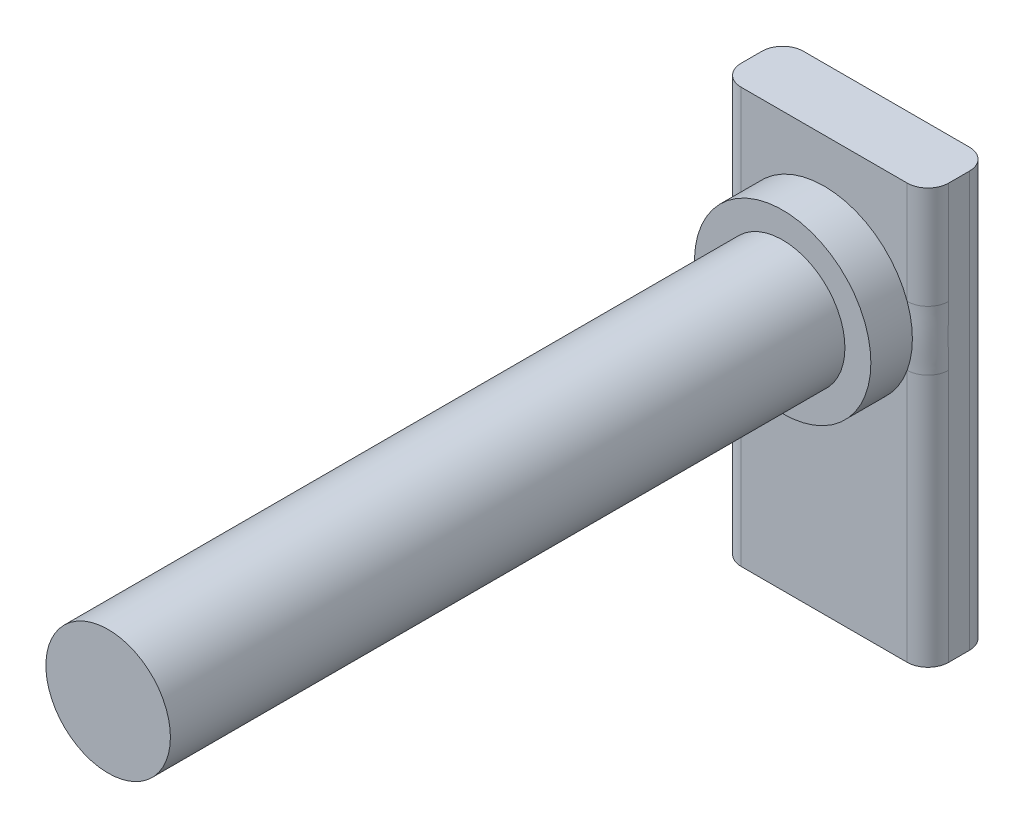
ISO-10303-21;
HEADER;
FILE_DESCRIPTION(('STEP AP214'),'2;1');
FILE_NAME('part.step','',(''),(''),'','','');
FILE_SCHEMA(('AUTOMOTIVE_DESIGN { 1 0 10303 214 1 1 1 1 }'));
ENDSEC;
DATA;
#1=APPLICATION_CONTEXT('core data for automotive mechanical design processes');
#2=APPLICATION_PROTOCOL_DEFINITION('international standard','automotive_design',2000,#1);
#3=PRODUCT_CONTEXT('',#1,'mechanical');
#4=PRODUCT('Part','Part','',(#3));
#5=PRODUCT_RELATED_PRODUCT_CATEGORY('part','',(#4));
#6=PRODUCT_DEFINITION_FORMATION('','',#4);
#7=PRODUCT_DEFINITION_CONTEXT('part definition',#1,'design');
#8=PRODUCT_DEFINITION('design','',#6,#7);
#9=PRODUCT_DEFINITION_SHAPE('','',#8);
#10=(LENGTH_UNIT() NAMED_UNIT(*) SI_UNIT(.MILLI.,.METRE.));
#11=(NAMED_UNIT(*) PLANE_ANGLE_UNIT() SI_UNIT($,.RADIAN.));
#12=(NAMED_UNIT(*) SI_UNIT($,.STERADIAN.) SOLID_ANGLE_UNIT());
#13=UNCERTAINTY_MEASURE_WITH_UNIT(LENGTH_MEASURE(1.E-05),#10,'distance_accuracy_value','');
#14=(GEOMETRIC_REPRESENTATION_CONTEXT(3) GLOBAL_UNCERTAINTY_ASSIGNED_CONTEXT((#13)) GLOBAL_UNIT_ASSIGNED_CONTEXT((#10,
#11,#12)) REPRESENTATION_CONTEXT('',''));
#15=CARTESIAN_POINT('',(0.,0.,0.));
#16=DIRECTION('',(0.,0.,1.));
#17=DIRECTION('',(1.,0.,0.));
#18=AXIS2_PLACEMENT_3D('',#15,#16,#17);
#19=CARTESIAN_POINT('',(-10.,40.,3.));
#20=DIRECTION('',(0.,0.,-1.));
#21=DIRECTION('',(-1.,0.,0.));
#22=AXIS2_PLACEMENT_3D('',#19,#20,#21);
#23=PLANE('',#22);
#24=DIRECTION('',(1.,0.,0.));
#25=VECTOR('',#24,1.);
#26=CARTESIAN_POINT('',(-10.,40.,3.));
#27=LINE('',#26,#25);
#28=CARTESIAN_POINT('',(-8.,40.,3.));
#29=VERTEX_POINT('',#28);
#30=CARTESIAN_POINT('',(8.,40.,3.));
#31=VERTEX_POINT('',#30);
#32=EDGE_CURVE('E286',#29,#31,#27,.T.);
#33=ORIENTED_EDGE('',*,*,#32,.F.);
#34=DIRECTION('',(0.,-1.,0.));
#35=VECTOR('',#34,1.);
#36=CARTESIAN_POINT('',(-8.,40.,3.));
#37=LINE('',#36,#35);
#38=CARTESIAN_POINT('',(-8.,30.122281323269,3.));
#39=VERTEX_POINT('',#38);
#40=EDGE_CURVE('E169',#29,#39,#37,.T.);
#41=ORIENTED_EDGE('',*,*,#40,.T.);
#42=CARTESIAN_POINT('',(0.,27.25,3.));
#43=DIRECTION('',(0.,0.,-1.));
#44=DIRECTION('',(-1.,0.,0.));
#45=AXIS2_PLACEMENT_3D('',#42,#43,#44);
#46=CIRCLE('',#45,8.5);
#47=CARTESIAN_POINT('',(8.,30.122281323269,3.));
#48=VERTEX_POINT('',#47);
#49=EDGE_CURVE('E144',#48,#39,#46,.F.);
#50=ORIENTED_EDGE('',*,*,#49,.F.);
#51=DIRECTION('',(0.,-1.,0.));
#52=VECTOR('',#51,1.);
#53=CARTESIAN_POINT('',(8.,40.,3.));
#54=LINE('',#53,#52);
#55=EDGE_CURVE('E159',#48,#31,#54,.F.);
#56=ORIENTED_EDGE('',*,*,#55,.T.);
#57=EDGE_LOOP('',(#33,#41,#50,#56));
#58=FACE_BOUND('',#57,.T.);
#59=ADVANCED_FACE('F39',(#58),#23,.F.);
#60=CARTESIAN_POINT('',(-10.,40.,-3.));
#61=DIRECTION('',(1.,0.,0.));
#62=DIRECTION('',(0.,0.,-1.));
#63=AXIS2_PLACEMENT_3D('',#60,#61,#62);
#64=PLANE('',#63);
#65=DIRECTION('',(0.,0.,1.));
#66=VECTOR('',#65,1.);
#67=CARTESIAN_POINT('',(-10.,0.,-3.));
#68=LINE('',#67,#66);
#69=CARTESIAN_POINT('',(-10.,0.,-1.));
#70=VERTEX_POINT('',#69);
#71=CARTESIAN_POINT('',(-10.,0.,1.));
#72=VERTEX_POINT('',#71);
#73=EDGE_CURVE('E348',#70,#72,#68,.T.);
#74=ORIENTED_EDGE('',*,*,#73,.T.);
#75=DIRECTION('',(0.,-1.,0.));
#76=VECTOR('',#75,1.);
#77=CARTESIAN_POINT('',(-10.,40.,1.));
#78=LINE('',#77,#76);
#79=CARTESIAN_POINT('',(-10.,24.377718676731,1.));
#80=VERTEX_POINT('',#79);
#81=EDGE_CURVE('E333',#72,#80,#78,.F.);
#82=ORIENTED_EDGE('',*,*,#81,.T.);
#83=CARTESIAN_POINT('',(-10.,32.1742305538704,1.21095364486494));
#84=CARTESIAN_POINT('',(-10.,31.4175147859242,4.09970453840796));
#85=CARTESIAN_POINT('',(-7.23862971994848,31.7055852340045,3.));
#86=CARTESIAN_POINT('',(-10.,32.0611079786536,1.18135774137184));
#87=CARTESIAN_POINT('',(-10.,31.39549822083,4.01275273274164));
#88=CARTESIAN_POINT('',(-7.2843148394478,31.6313757692248,3.));
#89=CARTESIAN_POINT('',(-10.,31.9470060698169,1.15585246402786));
#90=CARTESIAN_POINT('',(-10.,31.3597545242937,3.92803932344696));
#91=CARTESIAN_POINT('',(-7.33013269160796,31.5543717103597,3.));
#92=CARTESIAN_POINT('',(-10.,31.7175920562914,1.11188087408796));
#93=CARTESIAN_POINT('',(-10.,31.2667596127327,3.76815384213583));
#94=CARTESIAN_POINT('',(-7.42135843620194,31.3950962960003,3.));
#95=CARTESIAN_POINT('',(-10.,31.6022816838911,1.09340561061509));
#96=CARTESIAN_POINT('',(-10.,31.2101429271235,3.69252360930276));
#97=CARTESIAN_POINT('',(-7.46676677759371,31.3128317953243,3.));
#98=CARTESIAN_POINT('',(-10.,31.3714987813985,1.06236171776447));
#99=CARTESIAN_POINT('',(-10.,31.0810369633531,3.55171605711475));
#100=CARTESIAN_POINT('',(-7.5563881842569,31.1436005186026,3.));
#101=CARTESIAN_POINT('',(-10.,31.2560300968972,1.04976336246578));
#102=CARTESIAN_POINT('',(-10.,31.0089798835651,3.48607680965296));
#103=CARTESIAN_POINT('',(-7.60060617493571,31.0566599439555,3.));
#104=CARTESIAN_POINT('',(-10.,31.0246419075179,1.02933544634426));
#105=CARTESIAN_POINT('',(-10.,30.8526620066706,3.36434357875298));
#106=CARTESIAN_POINT('',(-7.68755980963737,30.8778528735251,3.));
#107=CARTESIAN_POINT('',(-10.,30.9087222589015,1.02150755738733));
#108=CARTESIAN_POINT('',(-10.,30.7685609346231,3.30788932172753));
#109=CARTESIAN_POINT('',(-7.730294929028,30.7859846630522,3.));
#110=CARTESIAN_POINT('',(-10.,30.5619183886198,1.00385470347928));
#111=CARTESIAN_POINT('',(-10.,30.5062691683153,3.15427856502097));
#112=CARTESIAN_POINT('',(-7.85503489667644,30.5042906134472,3.));
#113=CARTESIAN_POINT('',(-10.,30.3307571929287,0.999715917369383));
#114=CARTESIAN_POINT('',(-10.,30.3114667741329,3.06680903547543));
#115=CARTESIAN_POINT('',(-7.93406173340116,30.3074718790006,3.));
#116=CARTESIAN_POINT('',(-10.,29.8682135241245,1.00031354631181));
#117=CARTESIAN_POINT('',(-10.,29.9001338176205,2.92143089467112));
#118=CARTESIAN_POINT('',(-8.08040028074587,29.8966500098235,3.));
#119=CARTESIAN_POINT('',(-10.,29.6368312222705,1.00506295888962));
#120=CARTESIAN_POINT('',(-10.,29.6827498479941,2.86195918734718));
#121=CARTESIAN_POINT('',(-8.14769467728004,29.682622147642,3.));
#122=CARTESIAN_POINT('',(-10.,29.1569620354086,1.01853515381541));
#123=CARTESIAN_POINT('',(-10.,29.2193368637906,2.76235809361198));
#124=CARTESIAN_POINT('',(-8.27135516333418,29.2236328276485,3.));
#125=CARTESIAN_POINT('',(-10.,28.908483985395,1.02752738419817));
#126=CARTESIAN_POINT('',(-10.,28.9701752541155,2.72272542112594));
#127=CARTESIAN_POINT('',(-8.32653492488588,28.9775546651703,3.));
#128=CARTESIAN_POINT('',(-10.,28.4116163754647,1.04405910861875));
#129=CARTESIAN_POINT('',(-10.,28.4649689258032,2.66318367046132));
#130=CARTESIAN_POINT('',(-8.4153992799378,28.4733162510156,3.));
#131=CARTESIAN_POINT('',(-10.,28.1632268469108,1.05159943567479));
#132=CARTESIAN_POINT('',(-10.,28.2066888657191,2.64262109487295));
#133=CARTESIAN_POINT('',(-8.44909622483952,28.2151630336255,3.));
#134=CARTESIAN_POINT('',(-10.,27.6661063063211,1.06160028312711));
#135=CARTESIAN_POINT('',(-10.,27.6882489902641,2.61686176603129));
#136=CARTESIAN_POINT('',(-8.49253167471214,27.6924036973262,3.));
#137=CARTESIAN_POINT('',(-10.,27.4173751868783,1.06405628854081));
#138=CARTESIAN_POINT('',(-10.,27.4255748641736,2.61141857767124));
#139=CARTESIAN_POINT('',(-8.50224888665426,27.4277920539613,3.));
#140=CARTESIAN_POINT('',(-10.,26.919888048319,1.06274677884511));
#141=CARTESIAN_POINT('',(-10.,26.9032764860434,2.61448866869509));
#142=CARTESIAN_POINT('',(-8.49687185453577,26.8993090777777,3.));
#143=CARTESIAN_POINT('',(-10.,26.6711320327885,1.05898014292222));
#144=CARTESIAN_POINT('',(-10.,26.6410634368824,2.62303477231418));
#145=CARTESIAN_POINT('',(-8.48177314066766,26.6354378869039,3.));
#146=CARTESIAN_POINT('',(-10.,26.2589159364716,1.04904307632406));
#147=CARTESIAN_POINT('',(-10.,26.2136038980973,2.64996515719741));
#148=CARTESIAN_POINT('',(-8.43720189599295,26.2043901872877,3.));
#149=CARTESIAN_POINT('',(-10.,26.0954204080665,1.04413766495513));
#150=CARTESIAN_POINT('',(-10.,26.0444939872155,2.66412486846108));
#151=CARTESIAN_POINT('',(-8.41442292464661,26.0350472918182,3.));
#152=CARTESIAN_POINT('',(-10.,25.7684723838228,1.03350589729117));
#153=CARTESIAN_POINT('',(-10.,25.7106453381815,2.70025292082646));
#154=CARTESIAN_POINT('',(-8.35944007986045,25.701346384731,3.));
#155=CARTESIAN_POINT('',(-10.,25.6050198854074,1.02777961667695));
#156=CARTESIAN_POINT('',(-10.,25.5452563336138,2.72238744351901));
#157=CARTESIAN_POINT('',(-8.32723707499358,25.5369879152601,3.));
#158=CARTESIAN_POINT('',(-10.,25.2782637020742,1.01692019739131));
#159=CARTESIAN_POINT('',(-10.,25.2206604420998,2.7759061619357));
#160=CARTESIAN_POINT('',(-8.25441048197649,25.2148172799662,3.));
#161=CARTESIAN_POINT('',(-10.,25.1149600394352,1.01178644727281));
#162=CARTESIAN_POINT('',(-10.,25.0608716392072,2.8075412961384));
#163=CARTESIAN_POINT('',(-8.21379569735163,25.0569984755063,3.));
#164=CARTESIAN_POINT('',(-10.,24.7882990823041,1.00380039117724));
#165=CARTESIAN_POINT('',(-10.,24.7494108213875,2.88186810940857));
#166=CARTESIAN_POINT('',(-8.12526598223164,24.7488494785581,3.));
#167=CARTESIAN_POINT('',(-10.,24.6249417913994,1.0009479551823));
#168=CARTESIAN_POINT('',(-10.,24.5972728511241,2.92494111576139));
#169=CARTESIAN_POINT('',(-8.07735146795188,24.5985188597572,3.));
#170=CARTESIAN_POINT('',(-10.,24.2862575691042,0.999388150210553));
#171=CARTESIAN_POINT('',(-10.,24.293010901867,3.02790455164852));
#172=CARTESIAN_POINT('',(-7.97174289051109,24.2955291406349,3.));
#173=CARTESIAN_POINT('',(-10.,24.1109275108449,1.00099862008363));
#174=CARTESIAN_POINT('',(-10.,24.1416302241075,3.08933725599558));
#175=CARTESIAN_POINT('',(-7.91359022723904,24.1435013809035,3.));
#176=CARTESIAN_POINT('',(-10.,23.7606080775338,1.01171589094146));
#177=CARTESIAN_POINT('',(-10.,23.8568927412528,3.22975908509041));
#178=CARTESIAN_POINT('',(-7.79199829839254,23.8500027060113,3.));
#179=CARTESIAN_POINT('',(-10.,23.585618541079,1.02081655302892));
#180=CARTESIAN_POINT('',(-10.,23.7234635399509,3.30965900255887));
#181=CARTESIAN_POINT('',(-7.72856340034755,23.7085232490758,3.));
#182=CARTESIAN_POINT('',(-10.,23.2350646098877,1.04963867428003));
#183=CARTESIAN_POINT('',(-10.,23.4813967476423,3.48998797639246));
#184=CARTESIAN_POINT('',(-7.59758387340209,23.4355804147346,3.));
#185=CARTESIAN_POINT('',(-10.,23.0595061511386,1.06944131102034));
#186=CARTESIAN_POINT('',(-10.,23.3734949343701,3.5917957419354));
#187=CARTESIAN_POINT('',(-7.53001137945784,23.3042024761798,3.));
#188=CARTESIAN_POINT('',(-10.,22.7975517377895,1.10986863126105));
#189=CARTESIAN_POINT('',(-10.,23.2421136445889,3.75807507381838));
#190=CARTESIAN_POINT('',(-7.42728422373314,23.1159235226725,3.));
#191=CARTESIAN_POINT('',(-10.,22.7103346219837,1.12516260247632));
#192=CARTESIAN_POINT('',(-10.,23.2028658035795,3.81711114874101));
#193=CARTESIAN_POINT('',(-7.39276105715877,23.0545432608375,3.));
#194=CARTESIAN_POINT('',(-10.,22.5366709522816,1.15987004434311));
#195=CARTESIAN_POINT('',(-10.,23.1365175033274,3.94012067376457));
#196=CARTESIAN_POINT('',(-7.32353753322398,22.9348424366964,3.));
#197=CARTESIAN_POINT('',(-10.,22.450224922852,1.17928612467114));
#198=CARTESIAN_POINT('',(-10.,23.1097069601356,4.00429324037911));
#199=CARTESIAN_POINT('',(-7.28883707726927,22.8765238420201,3.));
#200=CARTESIAN_POINT('',(-10.,22.3643294372693,1.20102259422304));
#201=CARTESIAN_POINT('',(-10.,23.0906453720776,4.0697618182808));
#202=CARTESIAN_POINT('',(-7.25419375221729,22.8197998910555,3.));
#203=(BOUNDED_SURFACE() B_SPLINE_SURFACE(3,2,((#83,#84,#85),(#86,#87,#88),(#89,#90,#91),(#92,
#93,#94),(#95,#96,#97),(#98,#99,#100),(#101,#102,#103),(#104,#105,#106),(#107,#108,#109),(#110,
#111,#112),(#113,#114,#115),(#116,#117,#118),(#119,#120,#121),(#122,#123,#124),(#125,#126,#127),
(#128,#129,#130),(#131,#132,#133),(#134,#135,#136),(#137,#138,#139),(#140,#141,#142),(#143,#144,
#145),(#146,#147,#148),(#149,#150,#151),(#152,#153,#154),(#155,#156,#157),(#158,#159,#160),
(#161,#162,#163),(#164,#165,#166),(#167,#168,#169),(#170,#171,#172),(#173,#174,#175),(#176,#177,
#178),(#179,#180,#181),(#182,#183,#184),(#185,#186,#187),(#188,#189,#190),(#191,#192,#193),
(#194,#195,#196),(#197,#198,#199),(#200,#201,#202)),.UNSPECIFIED.,.F.,.F.,
.F.) B_SPLINE_SURFACE_WITH_KNOTS((4,2,2,2,2,2,2,2,2,2,2,2,2,2,2,2,2,2,2,4),(3,3),(0.,
0.350587874443632,0.700727861604529,1.04907707501846,1.39754830139852,2.09077806843667,
2.78502236195023,3.53094372950157,4.27643584687634,5.02258969315867,5.76887795028599,
6.25958199540092,6.75024082865455,7.2403887241767,7.73050868294059,8.25641259113918,
8.78188590172446,9.31140219902955,9.57695662561053,9.84267967674416),(0.,1.),
.UNSPECIFIED.) GEOMETRIC_REPRESENTATION_ITEM() RATIONAL_B_SPLINE_SURFACE(((1.,0.556468714293195,
1.),(1.,0.566731908977172,1.),(1.,0.576739177256572,1.),(1.,0.596182629575777,1.),(1.,
0.605619526861314,1.),(1.,0.623842746561731,1.),(1.,0.632632149463142,1.),(1.,0.649585847703021,
1.),(1.,0.657749923012702,1.),(1.,0.68117703495113,1.),(1.,0.695472360590649,1.),(1.,
0.721295442439472,1.),(1.,0.732819117754684,1.),(1.,0.75362817110224,1.),(1.,0.762683088060061,
1.),(1.,0.777111411886055,1.),(1.,0.782486934328605,1.),(1.,0.789395360913482,1.),(1.,
0.790924849957231,1.),(1.,0.790074951022299,1.),(1.,0.787694858855736,1.),(1.,0.780581487233211,
1.),(1.,0.776933269939079,1.),(1.,0.768036471580732,1.),(1.,0.762788037999756,1.),(1.,
0.750758716728986,1.),(1.,0.743979430520764,1.),(1.,0.728953303786449,1.),(1.,0.720706546927971,
1.),(1.,0.702159435581077,1.),(1.,0.691753106433346,1.),(1.,0.669420748345164,1.),(1.,
0.657495970675108,1.),(1.,0.632106155436567,1.),(1.,0.618629973039805,1.),(1.,0.597387124379166,
1.),(1.,0.590123096737183,1.),(1.,0.575273529030415,1.),(1.,0.567687787737227,1.),(1.,
0.559953960655983,1.))) REPRESENTATION_ITEM('') SURFACE());
#204=CARTESIAN_POINT('',(-10.,22.3643294372693,1.20102259422304));
#205=CARTESIAN_POINT('',(-10.,22.450224922852,1.17928612467114));
#206=CARTESIAN_POINT('',(-10.,22.5366709522816,1.15987004434311));
#207=CARTESIAN_POINT('',(-10.,22.7103346219837,1.12516260247632));
#208=CARTESIAN_POINT('',(-10.,22.7975517377895,1.10986863126105));
#209=CARTESIAN_POINT('',(-10.,23.0595061511386,1.06944131102034));
#210=CARTESIAN_POINT('',(-10.,23.2350646098877,1.04963867428003));
#211=CARTESIAN_POINT('',(-10.,23.585618541079,1.02081655302892));
#212=CARTESIAN_POINT('',(-10.,23.7606080775338,1.01171589094146));
#213=CARTESIAN_POINT('',(-10.,24.1109275108449,1.00099862008363));
#214=CARTESIAN_POINT('',(-10.,24.2862575691042,0.999388150210553));
#215=CARTESIAN_POINT('',(-10.,24.6249417913994,1.0009479551823));
#216=CARTESIAN_POINT('',(-10.,24.7882990823041,1.00380039117724));
#217=CARTESIAN_POINT('',(-10.,25.1149600394352,1.01178644727281));
#218=CARTESIAN_POINT('',(-10.,25.2782637020742,1.01692019739131));
#219=CARTESIAN_POINT('',(-10.,25.6050198854074,1.02777961667695));
#220=CARTESIAN_POINT('',(-10.,25.7684723838228,1.03350589729117));
#221=CARTESIAN_POINT('',(-10.,26.0954204080665,1.04413766495513));
#222=CARTESIAN_POINT('',(-10.,26.2589159364716,1.04904307632406));
#223=CARTESIAN_POINT('',(-10.,26.6711320327885,1.05898014292222));
#224=CARTESIAN_POINT('',(-10.,26.919888048319,1.06274677884511));
#225=CARTESIAN_POINT('',(-10.,27.4173751868783,1.06405628854081));
#226=CARTESIAN_POINT('',(-10.,27.6661063063211,1.06160028312711));
#227=CARTESIAN_POINT('',(-10.,28.1632268469108,1.05159943567479));
#228=CARTESIAN_POINT('',(-10.,28.4116163754647,1.04405910861875));
#229=CARTESIAN_POINT('',(-10.,28.9084839853949,1.02752738419817));
#230=CARTESIAN_POINT('',(-10.,29.1569620354086,1.01853515381541));
#231=CARTESIAN_POINT('',(-10.,29.6368312222705,1.00506295888962));
#232=CARTESIAN_POINT('',(-10.,29.8682135241245,1.00031354631181));
#233=CARTESIAN_POINT('',(-10.,30.3307571929287,0.999715917369383));
#234=CARTESIAN_POINT('',(-10.,30.5619183886198,1.00385470347928));
#235=CARTESIAN_POINT('',(-10.,30.9087222589015,1.02150755738733));
#236=CARTESIAN_POINT('',(-10.,31.0246419075179,1.02933544634426));
#237=CARTESIAN_POINT('',(-10.,31.2560300968972,1.04976336246578));
#238=CARTESIAN_POINT('',(-10.,31.3714987813985,1.06236171776447));
#239=CARTESIAN_POINT('',(-10.,31.6022816838911,1.09340561061509));
#240=CARTESIAN_POINT('',(-10.,31.7175920562914,1.11188087408796));
#241=CARTESIAN_POINT('',(-10.,31.9470060698169,1.15585246402786));
#242=CARTESIAN_POINT('',(-10.,32.0611079786536,1.18135774137184));
#243=CARTESIAN_POINT('',(-10.,32.1742305538704,1.21095364486494));
#244=B_SPLINE_CURVE_WITH_KNOTS('',3,(#204,#205,#206,#207,#208,#209,#210,#211,#212,#213,#214,
#215,#216,#217,#218,#219,#220,#221,#222,#223,#224,#225,#226,#227,#228,#229,#230,#231,#232,#233,
#234,#235,#236,#237,#238,#239,#240,#241,#242,#243),.UNSPECIFIED.,.F.,.F.,(4,2,2,2,2,2,2,2,2,2,2,
2,2,2,2,2,2,2,2,4),(0.,0.265723051133621,0.531277477714602,1.0607937750197,1.58626708560497,
2.11217099380357,2.60229095256745,3.09243884808961,3.58309768134323,4.07380172645817,
4.82008998358548,5.56624382986782,6.31173594724259,7.05765731479392,7.75190160830748,
8.44513137534564,8.79360260172569,9.14195181513963,9.49209180230052,9.84267967674416),.UNSPECIFIED.);
#245=CARTESIAN_POINT('',(-10.,30.122281323269,1.));
#246=VERTEX_POINT('',#245);
#247=EDGE_CURVE('E172',#80,#246,#244,.T.);
#248=ORIENTED_EDGE('',*,*,#247,.T.);
#249=DIRECTION('',(0.,-1.,0.));
#250=VECTOR('',#249,1.);
#251=CARTESIAN_POINT('',(-10.,40.,1.));
#252=LINE('',#251,#250);
#253=CARTESIAN_POINT('',(-10.,40.,1.));
#254=VERTEX_POINT('',#253);
#255=EDGE_CURVE('E326',#246,#254,#252,.F.);
#256=ORIENTED_EDGE('',*,*,#255,.T.);
#257=DIRECTION('',(0.,0.,1.));
#258=VECTOR('',#257,1.);
#259=CARTESIAN_POINT('',(-10.,40.,-3.));
#260=LINE('',#259,#258);
#261=CARTESIAN_POINT('',(-10.,40.,-1.));
#262=VERTEX_POINT('',#261);
#263=EDGE_CURVE('E304',#262,#254,#260,.T.);
#264=ORIENTED_EDGE('',*,*,#263,.F.);
#265=DIRECTION('',(0.,-1.,0.));
#266=VECTOR('',#265,1.);
#267=CARTESIAN_POINT('',(-10.,40.,-1.));
#268=LINE('',#267,#266);
#269=EDGE_CURVE('E323',#262,#70,#268,.T.);
#270=ORIENTED_EDGE('',*,*,#269,.T.);
#271=EDGE_LOOP('',(#74,#82,#248,#256,#264,#270));
#272=FACE_BOUND('',#271,.T.);
#273=ADVANCED_FACE('F262',(#272),#64,.F.);
#274=CARTESIAN_POINT('',(-8.,24.377718676731,3.));
#275=VERTEX_POINT('',#274);
#276=CARTESIAN_POINT('',(8.,24.377718676731,3.));
#277=VERTEX_POINT('',#276);
#278=EDGE_CURVE('E142',#275,#277,#46,.F.);
#279=ORIENTED_EDGE('',*,*,#278,.F.);
#280=DIRECTION('',(0.,-1.,0.));
#281=VECTOR('',#280,1.);
#282=CARTESIAN_POINT('',(-8.,40.,3.));
#283=LINE('',#282,#281);
#284=CARTESIAN_POINT('',(-8.,0.,3.));
#285=VERTEX_POINT('',#284);
#286=EDGE_CURVE('E155',#275,#285,#283,.T.);
#287=ORIENTED_EDGE('',*,*,#286,.T.);
#288=DIRECTION('',(1.,0.,0.));
#289=VECTOR('',#288,1.);
#290=CARTESIAN_POINT('',(-10.,0.,3.));
#291=LINE('',#290,#289);
#292=CARTESIAN_POINT('',(8.,0.,3.));
#293=VERTEX_POINT('',#292);
#294=EDGE_CURVE('E309',#285,#293,#291,.T.);
#295=ORIENTED_EDGE('',*,*,#294,.T.);
#296=DIRECTION('',(0.,-1.,0.));
#297=VECTOR('',#296,1.);
#298=CARTESIAN_POINT('',(8.,40.,3.));
#299=LINE('',#298,#297);
#300=EDGE_CURVE('E158',#293,#277,#299,.F.);
#301=ORIENTED_EDGE('',*,*,#300,.T.);
#302=EDGE_LOOP('',(#279,#287,#295,#301));
#303=FACE_BOUND('',#302,.T.);
#304=ADVANCED_FACE('F153',(#303),#23,.F.);
#305=CARTESIAN_POINT('',(10.,40.,-3.));
#306=DIRECTION('',(-1.,0.,0.));
#307=DIRECTION('',(0.,0.,1.));
#308=AXIS2_PLACEMENT_3D('',#305,#306,#307);
#309=PLANE('',#308);
#310=DIRECTION('',(0.,0.,-1.));
#311=VECTOR('',#310,1.);
#312=CARTESIAN_POINT('',(10.,40.,-3.));
#313=LINE('',#312,#311);
#314=CARTESIAN_POINT('',(10.,40.,1.));
#315=VERTEX_POINT('',#314);
#316=CARTESIAN_POINT('',(10.,40.,-1.));
#317=VERTEX_POINT('',#316);
#318=EDGE_CURVE('E282',#315,#317,#313,.T.);
#319=ORIENTED_EDGE('',*,*,#318,.F.);
#320=DIRECTION('',(0.,-1.,0.));
#321=VECTOR('',#320,1.);
#322=CARTESIAN_POINT('',(10.,40.,1.));
#323=LINE('',#322,#321);
#324=CARTESIAN_POINT('',(10.,30.122281323269,1.));
#325=VERTEX_POINT('',#324);
#326=EDGE_CURVE('E234',#315,#325,#323,.T.);
#327=ORIENTED_EDGE('',*,*,#326,.T.);
#328=CARTESIAN_POINT('',(7.23862976044613,31.7055851682112,3.));
#329=CARTESIAN_POINT('',(10.,31.4175147044298,4.09970444395874));
#330=CARTESIAN_POINT('',(10.,32.1742305538704,1.21095364486494));
#331=CARTESIAN_POINT('',(7.28431485394318,31.6313757456756,3.));
#332=CARTESIAN_POINT('',(10.,31.3954981922558,4.01275270003417));
#333=CARTESIAN_POINT('',(10.,32.0611079787517,1.18135774139857));
#334=CARTESIAN_POINT('',(7.33013269542133,31.554371704169,3.));
#335=CARTESIAN_POINT('',(10.,31.3597545168833,3.92803931509408));
#336=CARTESIAN_POINT('',(10.,31.9470060700148,1.1558524640733));
#337=CARTESIAN_POINT('',(7.42135843215888,31.3950963025927,3.));
#338=CARTESIAN_POINT('',(10.,31.2667596199878,3.76815385037683));
#339=CARTESIAN_POINT('',(10.,31.7175920566871,1.11188087415829));
#340=CARTESIAN_POINT('',(7.46676677635898,31.3128317973692,3.));
#341=CARTESIAN_POINT('',(10.,31.2101429292156,3.69252361169295));
#342=CARTESIAN_POINT('',(10.,31.6022816843848,1.09340561069186));
#343=CARTESIAN_POINT('',(7.55638818503085,31.1436005174263,3.));
#344=CARTESIAN_POINT('',(10.,31.0810369620247,3.55171605556082));
#345=CARTESIAN_POINT('',(10.,31.3714987820766,1.06236171784539));
#346=CARTESIAN_POINT('',(7.60060617492831,31.0566599440751,3.));
#347=CARTESIAN_POINT('',(10.,31.0089798835908,3.48607680955695));
#348=CARTESIAN_POINT('',(10.,31.2560300976616,1.04976336254501));
#349=CARTESIAN_POINT('',(7.68755980900572,30.8778528747196,3.));
#350=CARTESIAN_POINT('',(10.,30.8526620077626,3.36434357971663));
#351=CARTESIAN_POINT('',(10.,31.0246419084553,1.02933544641527));
#352=CARTESIAN_POINT('',(7.73029492855377,30.7859846640253,3.));
#353=CARTESIAN_POINT('',(10.,30.7685609355181,3.3078893223822));
#354=CARTESIAN_POINT('',(10.,30.9087222599252,1.0215075574518));
#355=CARTESIAN_POINT('',(7.85503489655323,30.5042906139201,3.));
#356=CARTESIAN_POINT('',(10.,30.5062691688338,3.15427856507399));
#357=CARTESIAN_POINT('',(10.,30.5619183895466,1.00385470350179));
#358=CARTESIAN_POINT('',(7.93406173321468,30.3074718796112,3.));
#359=CARTESIAN_POINT('',(10.,30.3114667747573,3.06680903564876));
#360=CARTESIAN_POINT('',(10.,30.3307571936705,0.999715917375612));
#361=CARTESIAN_POINT('',(8.08040028057978,29.8966500102025,3.));
#362=CARTESIAN_POINT('',(10.,29.9001338179915,2.92143089484788));
#363=CARTESIAN_POINT('',(10.,29.8682135244958,1.00031354630415));
#364=CARTESIAN_POINT('',(8.14769467719781,29.682622147651,3.));
#365=CARTESIAN_POINT('',(10.,29.6827498480394,2.8619591874218));
#366=CARTESIAN_POINT('',(10.,29.6368312224561,1.00506295888439));
#367=CARTESIAN_POINT('',(8.27135516337134,29.2236328278289,3.));
#368=CARTESIAN_POINT('',(10.,29.2193368639395,2.76235809357617));
#369=CARTESIAN_POINT('',(10.,29.1569620354085,1.01853515381543));
#370=CARTESIAN_POINT('',(8.32653492497256,28.9775546659613,3.));
#371=CARTESIAN_POINT('',(10.,28.9701752547367,2.72272542106429));
#372=CARTESIAN_POINT('',(10.,28.9084839853947,1.02752738419818));
#373=CARTESIAN_POINT('',(8.41539927985114,28.4733162502252,3.));
#374=CARTESIAN_POINT('',(10.,28.4649689251847,2.66318367052073));
#375=CARTESIAN_POINT('',(10.,28.4116163754645,1.04405910861875));
#376=CARTESIAN_POINT('',(8.44909622453018,28.2151630306447,3.));
#377=CARTESIAN_POINT('',(10.,28.2066888633967,2.64262109507396));
#378=CARTESIAN_POINT('',(10.,28.1632268469107,1.05159943567479));
#379=CARTESIAN_POINT('',(8.49253167502215,27.6924037003048,3.));
#380=CARTESIAN_POINT('',(10.,27.6882489925967,2.61686176583324));
#381=CARTESIAN_POINT('',(10.,27.6661063063199,1.06160028312714));
#382=CARTESIAN_POINT('',(8.50224888780711,27.4277920650989,3.));
#383=CARTESIAN_POINT('',(10.,27.4255748729366,2.61141857693971));
#384=CARTESIAN_POINT('',(10.,27.4173751868757,1.06405628854083));
#385=CARTESIAN_POINT('',(8.49687185338268,26.8993090666349,3.));
#386=CARTESIAN_POINT('',(10.,26.9032764771441,2.61448866942828));
#387=CARTESIAN_POINT('',(10.,26.9198880483164,1.06274677884507));
#388=CARTESIAN_POINT('',(8.48177313636534,26.6354378453147,3.));
#389=CARTESIAN_POINT('',(10.,26.641063403341,2.62303477506494));
#390=CARTESIAN_POINT('',(10.,26.6711320327872,1.05898014292219));
#391=CARTESIAN_POINT('',(8.43720189297792,26.2043901581407,3.));
#392=CARTESIAN_POINT('',(10.,26.2136038741138,2.64996515915925));
#393=CARTESIAN_POINT('',(10.,26.2589159364759,1.04904307632416));
#394=CARTESIAN_POINT('',(8.41442292383988,26.0350472840166,3.));
#395=CARTESIAN_POINT('',(10.,26.0444939807392,2.66412486899085));
#396=CARTESIAN_POINT('',(10.,26.0954204080751,1.04413766495539));
#397=CARTESIAN_POINT('',(8.35944008067144,25.7013463925582,3.));
#398=CARTESIAN_POINT('',(10.,25.7106453448149,2.70025292028167));
#399=CARTESIAN_POINT('',(10.,25.7684723838401,1.03350589729175));
#400=CARTESIAN_POINT('',(8.32723707521424,25.5369879173732,3.));
#401=CARTESIAN_POINT('',(10.,25.5452563354271,2.72238744336867));
#402=CARTESIAN_POINT('',(10.,25.605019885429,1.0277796166777));
#403=CARTESIAN_POINT('',(8.25441048176543,25.2148172778967,3.));
#404=CARTESIAN_POINT('',(10.,25.2206604402868,2.77590616208381));
#405=CARTESIAN_POINT('',(10.,25.2782637020958,1.01692019739199));
#406=CARTESIAN_POINT('',(8.21379569729796,25.0569984749611,3.));
#407=CARTESIAN_POINT('',(10.,25.0608716387245,2.80754129617646));
#408=CARTESIAN_POINT('',(10.,25.1149600394525,1.0117864472733));
#409=CARTESIAN_POINT('',(8.1252659822921,24.7488494791269,3.));
#410=CARTESIAN_POINT('',(10.,24.7494108219082,2.88186810936304));
#411=CARTESIAN_POINT('',(10.,24.7882990823127,1.00380039117739));
#412=CARTESIAN_POINT('',(8.07735146796908,24.5985188599158,3.));
#413=CARTESIAN_POINT('',(10.,24.5972728512715,2.92494111574801));
#414=CARTESIAN_POINT('',(10.,24.6249417914037,1.00094795518232));
#415=CARTESIAN_POINT('',(7.97174289049375,24.295529140468,3.));
#416=CARTESIAN_POINT('',(10.,24.2930109017068,3.02790455166257));
#417=CARTESIAN_POINT('',(10.,24.2862575691042,0.999388150210553));
#418=CARTESIAN_POINT('',(7.91359022723452,24.1435013808591,3.));
#419=CARTESIAN_POINT('',(10.,24.1416302240641,3.08933725599933));
#420=CARTESIAN_POINT('',(10.,24.1109275108449,1.00099862008363));
#421=CARTESIAN_POINT('',(7.79199829839739,23.8500027060564,3.));
#422=CARTESIAN_POINT('',(10.,23.8568927412987,3.22975908508598));
#423=CARTESIAN_POINT('',(10.,23.7606080775338,1.01171589094146));
#424=CARTESIAN_POINT('',(7.72856340034897,23.708523249088,3.));
#425=CARTESIAN_POINT('',(10.,23.7234635399636,3.30965900255747));
#426=CARTESIAN_POINT('',(10.,23.585618541079,1.02081655302892));
#427=CARTESIAN_POINT('',(7.59758387340103,23.435580414723,3.));
#428=CARTESIAN_POINT('',(10.,23.4813967476297,3.48998797639345));
#429=CARTESIAN_POINT('',(10.,23.2350646098877,1.04963867428003));
#430=CARTESIAN_POINT('',(7.53001137945776,23.3042024761777,3.));
#431=CARTESIAN_POINT('',(10.,23.3734949343678,3.5917957419354));
#432=CARTESIAN_POINT('',(10.,23.0595061511386,1.06944131102034));
#433=CARTESIAN_POINT('',(7.42728422373362,23.1159235226744,3.));
#434=CARTESIAN_POINT('',(10.,23.2421136445911,3.75807507381757));
#435=CARTESIAN_POINT('',(10.,22.7975517377895,1.10986863126105));
#436=CARTESIAN_POINT('',(7.39276105715929,23.0545432608389,3.));
#437=CARTESIAN_POINT('',(10.,23.2028658035812,3.81711114874005));
#438=CARTESIAN_POINT('',(10.,22.7103346219837,1.12516260247632));
#439=CARTESIAN_POINT('',(7.32353753322451,22.9348424366968,3.));
#440=CARTESIAN_POINT('',(10.,23.1365175033279,3.9401206737634));
#441=CARTESIAN_POINT('',(10.,22.5366709522816,1.15987004434311));
#442=CARTESIAN_POINT('',(7.28883707726978,22.8765238420199,3.));
#443=CARTESIAN_POINT('',(10.,23.1097069601354,4.0042932403779));
#444=CARTESIAN_POINT('',(10.,22.450224922852,1.17928612467114));
#445=CARTESIAN_POINT('',(7.25419375221786,22.8197998910565,3.));
#446=CARTESIAN_POINT('',(10.,23.0906453720788,4.0697618182795));
#447=CARTESIAN_POINT('',(10.,22.3643294372693,1.20102259422304));
#448=(BOUNDED_SURFACE() B_SPLINE_SURFACE(3,2,((#328,#329,#330),(#331,#332,#333),(#334,#335,
#336),(#337,#338,#339),(#340,#341,#342),(#343,#344,#345),(#346,#347,#348),(#349,#350,#351),
(#352,#353,#354),(#355,#356,#357),(#358,#359,#360),(#361,#362,#363),(#364,#365,#366),(#367,#368,
#369),(#370,#371,#372),(#373,#374,#375),(#376,#377,#378),(#379,#380,#381),(#382,#383,#384),
(#385,#386,#387),(#388,#389,#390),(#391,#392,#393),(#394,#395,#396),(#397,#398,#399),(#400,#401,
#402),(#403,#404,#405),(#406,#407,#408),(#409,#410,#411),(#412,#413,#414),(#415,#416,#417),
(#418,#419,#420),(#421,#422,#423),(#424,#425,#426),(#427,#428,#429),(#430,#431,#432),(#433,#434,
#435),(#436,#437,#438),(#439,#440,#441),(#442,#443,#444),(#445,#446,#447)),.UNSPECIFIED.,.F.,
.F.,.F.) B_SPLINE_SURFACE_WITH_KNOTS((4,2,2,2,2,2,2,2,2,2,2,2,2,2,2,2,2,2,2,4),(3,3),(0.,
0.350587874139403,0.70072786100764,1.04907707416453,1.39754830028729,2.09077806787969,
2.78502236195011,3.53094372950181,4.27643584687623,5.02258969316243,5.76887795028588,
6.25958199538785,6.7502408286285,7.24038872416362,7.73050868294048,8.25641259113909,
8.78188590172436,9.31140219902945,9.57695662561043,9.84267967674406),(0.,1.),
.UNSPECIFIED.) GEOMETRIC_REPRESENTATION_ITEM() RATIONAL_B_SPLINE_SURFACE(((1.,0.556468723390212,
1.),(1.,0.566731912233188,1.),(1.,0.576739178113572,1.),(1.,0.596182628669751,1.),(1.,
0.605619526587388,1.),(1.,0.623842746741851,1.),(1.,0.632632149469283,1.),(1.,0.649585847572279,
1.),(1.,0.657749922919131,1.),(1.,0.681177034936962,1.),(1.,0.695472360559631,1.),(1.,
0.721295442408272,1.),(1.,0.732819117740195,1.),(1.,0.753628171109192,1.),(1.,0.762683088074166,
1.),(1.,0.777111411871954,1.),(1.,0.782486934279173,1.),(1.,0.78939536096302,1.),(1.,
0.790924850141199,1.),(1.,0.790074950838293,1.),(1.,0.787694858169252,1.),(1.,0.780581486752133,
1.),(1.,0.776933269810358,1.),(1.,0.768036471710141,1.),(1.,0.76278803803498,1.),(1.,
0.750758716695345,1.),(1.,0.743979430512239,1.),(1.,0.728953303796126,1.),(1.,0.720706546930734,
1.),(1.,0.702159435578309,1.),(1.,0.691753106432627,1.),(1.,0.669420748345944,1.),(1.,
0.657495970675341,1.),(1.,0.632106155436404,1.),(1.,0.618629973039799,1.),(1.,0.597387124379261,
1.),(1.,0.590123096737291,1.),(1.,0.575273529030533,1.),(1.,0.567687787737345,1.),(1.,
0.55995396065611,1.))) REPRESENTATION_ITEM('') SURFACE());
#449=CARTESIAN_POINT('',(10.,32.1742305538704,1.21095364486494));
#450=CARTESIAN_POINT('',(10.,32.0611079787517,1.18135774139857));
#451=CARTESIAN_POINT('',(10.,31.9470060700148,1.1558524640733));
#452=CARTESIAN_POINT('',(10.,31.7175920566871,1.1118808741583));
#453=CARTESIAN_POINT('',(10.,31.6022816843848,1.09340561069186));
#454=CARTESIAN_POINT('',(10.,31.3714987820766,1.06236171784539));
#455=CARTESIAN_POINT('',(10.,31.2560300976616,1.04976336254501));
#456=CARTESIAN_POINT('',(10.,31.0246419084553,1.02933544641527));
#457=CARTESIAN_POINT('',(10.,30.9087222599252,1.0215075574518));
#458=CARTESIAN_POINT('',(10.,30.5619183895466,1.00385470350179));
#459=CARTESIAN_POINT('',(10.,30.3307571936705,0.999715917375612));
#460=CARTESIAN_POINT('',(10.,29.8682135244958,1.00031354630415));
#461=CARTESIAN_POINT('',(10.,29.6368312224561,1.00506295888439));
#462=CARTESIAN_POINT('',(10.,29.1569620354085,1.01853515381543));
#463=CARTESIAN_POINT('',(10.,28.9084839853947,1.02752738419818));
#464=CARTESIAN_POINT('',(10.,28.4116163754645,1.04405910861875));
#465=CARTESIAN_POINT('',(10.,28.1632268469107,1.05159943567479));
#466=CARTESIAN_POINT('',(10.,27.6661063063199,1.06160028312714));
#467=CARTESIAN_POINT('',(10.,27.4173751868757,1.06405628854083));
#468=CARTESIAN_POINT('',(10.,26.9198880483164,1.06274677884507));
#469=CARTESIAN_POINT('',(10.,26.6711320327872,1.05898014292219));
#470=CARTESIAN_POINT('',(10.,26.2589159364759,1.04904307632416));
#471=CARTESIAN_POINT('',(10.,26.0954204080751,1.04413766495539));
#472=CARTESIAN_POINT('',(10.,25.7684723838401,1.03350589729175));
#473=CARTESIAN_POINT('',(10.,25.605019885429,1.0277796166777));
#474=CARTESIAN_POINT('',(10.,25.2782637020958,1.01692019739199));
#475=CARTESIAN_POINT('',(10.,25.1149600394525,1.0117864472733));
#476=CARTESIAN_POINT('',(10.,24.7882990823127,1.00380039117739));
#477=CARTESIAN_POINT('',(10.,24.6249417914037,1.00094795518232));
#478=CARTESIAN_POINT('',(10.,24.2862575691042,0.999388150210553));
#479=CARTESIAN_POINT('',(10.,24.1109275108449,1.00099862008363));
#480=CARTESIAN_POINT('',(10.,23.7606080775338,1.01171589094146));
#481=CARTESIAN_POINT('',(10.,23.585618541079,1.02081655302892));
#482=CARTESIAN_POINT('',(10.,23.2350646098877,1.04963867428003));
#483=CARTESIAN_POINT('',(10.,23.0595061511386,1.06944131102034));
#484=CARTESIAN_POINT('',(10.,22.7975517377895,1.10986863126105));
#485=CARTESIAN_POINT('',(10.,22.7103346219837,1.12516260247632));
#486=CARTESIAN_POINT('',(10.,22.5366709522816,1.15987004434311));
#487=CARTESIAN_POINT('',(10.,22.450224922852,1.17928612467114));
#488=CARTESIAN_POINT('',(10.,22.3643294372693,1.20102259422304));
#489=B_SPLINE_CURVE_WITH_KNOTS('',3,(#449,#450,#451,#452,#453,#454,#455,#456,#457,#458,#459,
#460,#461,#462,#463,#464,#465,#466,#467,#468,#469,#470,#471,#472,#473,#474,#475,#476,#477,#478,
#479,#480,#481,#482,#483,#484,#485,#486,#487,#488),.UNSPECIFIED.,.F.,.F.,(4,2,2,2,2,2,2,2,2,2,2,
2,2,2,2,2,2,2,2,4),(0.,0.350587874139403,0.70072786100764,1.04907707416453,1.39754830028729,
2.09077806787969,2.78502236195011,3.53094372950181,4.27643584687623,5.02258969316243,
5.76887795028588,6.25958199538785,6.7502408286285,7.24038872416362,7.73050868294048,
8.25641259113909,8.78188590172436,9.31140219902945,9.57695662561043,9.84267967674406),.UNSPECIFIED.);
#490=CARTESIAN_POINT('',(10.,24.377718676731,1.));
#491=VERTEX_POINT('',#490);
#492=EDGE_CURVE('E69',#325,#491,#489,.T.);
#493=ORIENTED_EDGE('',*,*,#492,.T.);
#494=DIRECTION('',(0.,-1.,0.));
#495=VECTOR('',#494,1.);
#496=CARTESIAN_POINT('',(10.,40.,1.));
#497=LINE('',#496,#495);
#498=CARTESIAN_POINT('',(10.,0.,1.));
#499=VERTEX_POINT('',#498);
#500=EDGE_CURVE('E228',#491,#499,#497,.T.);
#501=ORIENTED_EDGE('',*,*,#500,.T.);
#502=DIRECTION('',(0.,0.,-1.));
#503=VECTOR('',#502,1.);
#504=CARTESIAN_POINT('',(10.,0.,-3.));
#505=LINE('',#504,#503);
#506=CARTESIAN_POINT('',(10.,0.,-1.));
#507=VERTEX_POINT('',#506);
#508=EDGE_CURVE('E305',#499,#507,#505,.T.);
#509=ORIENTED_EDGE('',*,*,#508,.T.);
#510=DIRECTION('',(0.,-1.,0.));
#511=VECTOR('',#510,1.);
#512=CARTESIAN_POINT('',(10.,40.,-1.));
#513=LINE('',#512,#511);
#514=EDGE_CURVE('E232',#507,#317,#513,.F.);
#515=ORIENTED_EDGE('',*,*,#514,.T.);
#516=EDGE_LOOP('',(#319,#327,#493,#501,#509,#515));
#517=FACE_BOUND('',#516,.T.);
#518=ADVANCED_FACE('F246',(#517),#309,.F.);
#519=CARTESIAN_POINT('',(-10.,40.,-3.));
#520=DIRECTION('',(0.,0.,1.));
#521=DIRECTION('',(1.,0.,0.));
#522=AXIS2_PLACEMENT_3D('',#519,#520,#521);
#523=PLANE('',#522);
#524=DIRECTION('',(-1.,0.,0.));
#525=VECTOR('',#524,1.);
#526=CARTESIAN_POINT('',(-10.,0.,-3.));
#527=LINE('',#526,#525);
#528=CARTESIAN_POINT('',(8.,0.,-3.));
#529=VERTEX_POINT('',#528);
#530=CARTESIAN_POINT('',(-8.,0.,-3.));
#531=VERTEX_POINT('',#530);
#532=EDGE_CURVE('E296',#529,#531,#527,.T.);
#533=ORIENTED_EDGE('',*,*,#532,.T.);
#534=DIRECTION('',(0.,-1.,0.));
#535=VECTOR('',#534,1.);
#536=CARTESIAN_POINT('',(-8.,40.,-3.));
#537=LINE('',#536,#535);
#538=CARTESIAN_POINT('',(-8.,40.,-3.));
#539=VERTEX_POINT('',#538);
#540=EDGE_CURVE('E11',#531,#539,#537,.F.);
#541=ORIENTED_EDGE('',*,*,#540,.T.);
#542=DIRECTION('',(-1.,0.,0.));
#543=VECTOR('',#542,1.);
#544=CARTESIAN_POINT('',(-10.,40.,-3.));
#545=LINE('',#544,#543);
#546=CARTESIAN_POINT('',(8.,40.,-3.));
#547=VERTEX_POINT('',#546);
#548=EDGE_CURVE('E149',#547,#539,#545,.T.);
#549=ORIENTED_EDGE('',*,*,#548,.F.);
#550=DIRECTION('',(0.,-1.,0.));
#551=VECTOR('',#550,1.);
#552=CARTESIAN_POINT('',(8.,40.,-3.));
#553=LINE('',#552,#551);
#554=EDGE_CURVE('E54',#547,#529,#553,.T.);
#555=ORIENTED_EDGE('',*,*,#554,.T.);
#556=EDGE_LOOP('',(#533,#541,#549,#555));
#557=FACE_BOUND('',#556,.T.);
#558=ADVANCED_FACE('F274',(#557),#523,.F.);
#559=CARTESIAN_POINT('',(0.,40.,0.));
#560=DIRECTION('',(0.,1.,0.));
#561=DIRECTION('',(0.,0.,1.));
#562=AXIS2_PLACEMENT_3D('',#559,#560,#561);
#563=PLANE('',#562);
#564=ORIENTED_EDGE('',*,*,#263,.T.);
#565=CARTESIAN_POINT('',(-8.,40.,1.));
#566=DIRECTION('',(0.,1.,0.));
#567=DIRECTION('',(0.,0.,1.));
#568=AXIS2_PLACEMENT_3D('',#565,#566,#567);
#569=CIRCLE('',#568,2.);
#570=EDGE_CURVE('E236',#254,#29,#569,.T.);
#571=ORIENTED_EDGE('',*,*,#570,.T.);
#572=ORIENTED_EDGE('',*,*,#32,.T.);
#573=CARTESIAN_POINT('',(8.,40.,1.));
#574=DIRECTION('',(0.,1.,0.));
#575=DIRECTION('',(0.,0.,1.));
#576=AXIS2_PLACEMENT_3D('',#573,#574,#575);
#577=CIRCLE('',#576,2.);
#578=EDGE_CURVE('E290',#31,#315,#577,.T.);
#579=ORIENTED_EDGE('',*,*,#578,.T.);
#580=ORIENTED_EDGE('',*,*,#318,.T.);
#581=CARTESIAN_POINT('',(8.,40.,-1.));
#582=DIRECTION('',(0.,1.,0.));
#583=DIRECTION('',(0.,0.,1.));
#584=AXIS2_PLACEMENT_3D('',#581,#582,#583);
#585=CIRCLE('',#584,2.);
#586=EDGE_CURVE('E337',#317,#547,#585,.T.);
#587=ORIENTED_EDGE('',*,*,#586,.T.);
#588=ORIENTED_EDGE('',*,*,#548,.T.);
#589=CARTESIAN_POINT('',(-8.,40.,-1.));
#590=DIRECTION('',(0.,1.,0.));
#591=DIRECTION('',(0.,0.,1.));
#592=AXIS2_PLACEMENT_3D('',#589,#590,#591);
#593=CIRCLE('',#592,2.);
#594=EDGE_CURVE('E339',#539,#262,#593,.T.);
#595=ORIENTED_EDGE('',*,*,#594,.T.);
#596=EDGE_LOOP('',(#564,#571,#572,#579,#580,#587,#588,#595));
#597=FACE_BOUND('',#596,.T.);
#598=ADVANCED_FACE('F278',(#597),#563,.T.);
#599=CARTESIAN_POINT('',(0.,0.,0.));
#600=DIRECTION('',(0.,1.,0.));
#601=DIRECTION('',(0.,0.,1.));
#602=AXIS2_PLACEMENT_3D('',#599,#600,#601);
#603=PLANE('',#602);
#604=ORIENTED_EDGE('',*,*,#294,.F.);
#605=CARTESIAN_POINT('',(-8.,0.,1.));
#606=DIRECTION('',(0.,1.,0.));
#607=DIRECTION('',(0.,0.,1.));
#608=AXIS2_PLACEMENT_3D('',#605,#606,#607);
#609=CIRCLE('',#608,2.);
#610=EDGE_CURVE('E168',#285,#72,#609,.F.);
#611=ORIENTED_EDGE('',*,*,#610,.T.);
#612=ORIENTED_EDGE('',*,*,#73,.F.);
#613=CARTESIAN_POINT('',(-8.,0.,-1.));
#614=DIRECTION('',(0.,1.,0.));
#615=DIRECTION('',(0.,0.,1.));
#616=AXIS2_PLACEMENT_3D('',#613,#614,#615);
#617=CIRCLE('',#616,2.);
#618=EDGE_CURVE('E303',#70,#531,#617,.F.);
#619=ORIENTED_EDGE('',*,*,#618,.T.);
#620=ORIENTED_EDGE('',*,*,#532,.F.);
#621=CARTESIAN_POINT('',(8.,0.,-1.));
#622=DIRECTION('',(0.,1.,0.));
#623=DIRECTION('',(0.,0.,1.));
#624=AXIS2_PLACEMENT_3D('',#621,#622,#623);
#625=CIRCLE('',#624,2.);
#626=EDGE_CURVE('E301',#529,#507,#625,.F.);
#627=ORIENTED_EDGE('',*,*,#626,.T.);
#628=ORIENTED_EDGE('',*,*,#508,.F.);
#629=CARTESIAN_POINT('',(8.,0.,1.));
#630=DIRECTION('',(0.,1.,0.));
#631=DIRECTION('',(0.,0.,1.));
#632=AXIS2_PLACEMENT_3D('',#629,#630,#631);
#633=CIRCLE('',#632,2.);
#634=EDGE_CURVE('E229',#499,#293,#633,.F.);
#635=ORIENTED_EDGE('',*,*,#634,.T.);
#636=EDGE_LOOP('',(#604,#611,#612,#619,#620,#627,#628,#635));
#637=FACE_BOUND('',#636,.T.);
#638=ADVANCED_FACE('F208',(#637),#603,.F.);
#639=CARTESIAN_POINT('',(0.,27.25,7.));
#640=DIRECTION('',(0.,0.,-1.));
#641=DIRECTION('',(-1.,0.,0.));
#642=AXIS2_PLACEMENT_3D('',#639,#640,#641);
#643=CYLINDRICAL_SURFACE('',#642,8.5);
#644=CARTESIAN_POINT('',(0.,27.25,7.));
#645=DIRECTION('',(0.,0.,1.));
#646=DIRECTION('',(1.,0.,0.));
#647=AXIS2_PLACEMENT_3D('',#644,#645,#646);
#648=CIRCLE('',#647,8.5);
#649=CARTESIAN_POINT('',(8.5,27.25,7.));
#650=VERTEX_POINT('',#649);
#651=EDGE_CURVE('E173',#650,#650,#648,.T.);
#652=ORIENTED_EDGE('',*,*,#651,.F.);
#653=EDGE_LOOP('',(#652));
#654=FACE_BOUND('',#653,.T.);
#655=ORIENTED_EDGE('',*,*,#278,.T.);
#656=EDGE_CURVE('E160',#277,#48,#46,.F.);
#657=ORIENTED_EDGE('',*,*,#656,.T.);
#658=ORIENTED_EDGE('',*,*,#49,.T.);
#659=EDGE_CURVE('E138',#39,#275,#46,.F.);
#660=ORIENTED_EDGE('',*,*,#659,.T.);
#661=EDGE_LOOP('',(#655,#657,#658,#660));
#662=FACE_BOUND('',#661,.T.);
#663=ADVANCED_FACE('F140',(#654,#662),#643,.T.);
#664=CARTESIAN_POINT('',(0.,27.25,7.));
#665=DIRECTION('',(0.,0.,1.));
#666=DIRECTION('',(1.,0.,0.));
#667=AXIS2_PLACEMENT_3D('',#664,#665,#666);
#668=PLANE('',#667);
#669=CARTESIAN_POINT('',(0.,27.25,7.00000000000001));
#670=DIRECTION('',(0.,0.,1.));
#671=DIRECTION('',(1.,0.,0.));
#672=AXIS2_PLACEMENT_3D('',#669,#670,#671);
#673=CIRCLE('',#672,6.);
#674=CARTESIAN_POINT('',(6.,27.25,7.00000000000001));
#675=VERTEX_POINT('',#674);
#676=EDGE_CURVE('E177',#675,#675,#673,.T.);
#677=ORIENTED_EDGE('',*,*,#676,.F.);
#678=EDGE_LOOP('',(#677));
#679=FACE_BOUND('',#678,.T.);
#680=ORIENTED_EDGE('',*,*,#651,.T.);
#681=EDGE_LOOP('',(#680));
#682=FACE_BOUND('',#681,.T.);
#683=ADVANCED_FACE('F207',(#679,#682),#668,.T.);
#684=CARTESIAN_POINT('',(0.,27.25,72.));
#685=DIRECTION('',(0.,0.,1.));
#686=DIRECTION('',(1.,0.,0.));
#687=AXIS2_PLACEMENT_3D('',#684,#685,#686);
#688=PLANE('',#687);
#689=CARTESIAN_POINT('',(0.,27.25,72.));
#690=DIRECTION('',(0.,0.,1.));
#691=DIRECTION('',(1.,0.,0.));
#692=AXIS2_PLACEMENT_3D('',#689,#690,#691);
#693=CIRCLE('',#692,6.);
#694=CARTESIAN_POINT('',(6.,27.25,72.));
#695=VERTEX_POINT('',#694);
#696=EDGE_CURVE('E314',#695,#695,#693,.T.);
#697=ORIENTED_EDGE('',*,*,#696,.T.);
#698=EDGE_LOOP('',(#697));
#699=FACE_BOUND('',#698,.T.);
#700=ADVANCED_FACE('F210',(#699),#688,.T.);
#701=CARTESIAN_POINT('',(0.,27.25,72.));
#702=DIRECTION('',(0.,0.,-1.));
#703=DIRECTION('',(-1.,0.,0.));
#704=AXIS2_PLACEMENT_3D('',#701,#702,#703);
#705=CYLINDRICAL_SURFACE('',#704,6.);
#706=ORIENTED_EDGE('',*,*,#676,.T.);
#707=EDGE_LOOP('',(#706));
#708=FACE_BOUND('',#707,.T.);
#709=ORIENTED_EDGE('',*,*,#696,.F.);
#710=EDGE_LOOP('',(#709));
#711=FACE_BOUND('',#710,.T.);
#712=ADVANCED_FACE('F367',(#708,#711),#705,.T.);
#713=CARTESIAN_POINT('',(-8.,40.,1.));
#714=DIRECTION('',(0.,-1.,0.));
#715=DIRECTION('',(0.,0.,-1.));
#716=AXIS2_PLACEMENT_3D('',#713,#714,#715);
#717=CYLINDRICAL_SURFACE('',#716,2.);
#718=ORIENTED_EDGE('',*,*,#610,.F.);
#719=ORIENTED_EDGE('',*,*,#286,.F.);
#720=CARTESIAN_POINT('',(-8.,24.377718676731,1.));
#721=DIRECTION('',(0.,1.,0.));
#722=DIRECTION('',(0.,0.,1.));
#723=AXIS2_PLACEMENT_3D('',#720,#721,#722);
#724=CIRCLE('',#723,2.);
#725=EDGE_CURVE('E166',#80,#275,#724,.T.);
#726=ORIENTED_EDGE('',*,*,#725,.F.);
#727=ORIENTED_EDGE('',*,*,#81,.F.);
#728=EDGE_LOOP('',(#718,#719,#726,#727));
#729=FACE_BOUND('',#728,.T.);
#730=ADVANCED_FACE('F164',(#729),#717,.T.);
#731=ORIENTED_EDGE('',*,*,#725,.T.);
#732=ORIENTED_EDGE('',*,*,#659,.F.);
#733=CARTESIAN_POINT('',(-8.,30.122281323269,1.));
#734=DIRECTION('',(0.,1.,0.));
#735=DIRECTION('',(0.,0.,1.));
#736=AXIS2_PLACEMENT_3D('',#733,#734,#735);
#737=CIRCLE('',#736,2.);
#738=EDGE_CURVE('E174',#246,#39,#737,.T.);
#739=ORIENTED_EDGE('',*,*,#738,.F.);
#740=ORIENTED_EDGE('',*,*,#247,.F.);
#741=EDGE_LOOP('',(#731,#732,#739,#740));
#742=FACE_BOUND('',#741,.T.);
#743=ADVANCED_FACE('F171',(#742),#203,.T.);
#744=CARTESIAN_POINT('',(-8.,40.,1.));
#745=DIRECTION('',(0.,-1.,0.));
#746=DIRECTION('',(0.,0.,-1.));
#747=AXIS2_PLACEMENT_3D('',#744,#745,#746);
#748=CYLINDRICAL_SURFACE('',#747,2.);
#749=ORIENTED_EDGE('',*,*,#570,.F.);
#750=ORIENTED_EDGE('',*,*,#255,.F.);
#751=ORIENTED_EDGE('',*,*,#738,.T.);
#752=ORIENTED_EDGE('',*,*,#40,.F.);
#753=EDGE_LOOP('',(#749,#750,#751,#752));
#754=FACE_BOUND('',#753,.T.);
#755=ADVANCED_FACE('F252',(#754),#748,.T.);
#756=CARTESIAN_POINT('',(8.,40.,1.));
#757=DIRECTION('',(0.,-1.,0.));
#758=DIRECTION('',(0.,0.,-1.));
#759=AXIS2_PLACEMENT_3D('',#756,#757,#758);
#760=CYLINDRICAL_SURFACE('',#759,2.);
#761=ORIENTED_EDGE('',*,*,#634,.F.);
#762=ORIENTED_EDGE('',*,*,#500,.F.);
#763=CARTESIAN_POINT('',(8.,24.377718676731,1.));
#764=DIRECTION('',(0.,1.,0.));
#765=DIRECTION('',(0.,0.,1.));
#766=AXIS2_PLACEMENT_3D('',#763,#764,#765);
#767=CIRCLE('',#766,2.);
#768=EDGE_CURVE('E179',#277,#491,#767,.T.);
#769=ORIENTED_EDGE('',*,*,#768,.F.);
#770=ORIENTED_EDGE('',*,*,#300,.F.);
#771=EDGE_LOOP('',(#761,#762,#769,#770));
#772=FACE_BOUND('',#771,.T.);
#773=ADVANCED_FACE('F227',(#772),#760,.T.);
#774=ORIENTED_EDGE('',*,*,#768,.T.);
#775=ORIENTED_EDGE('',*,*,#492,.F.);
#776=CARTESIAN_POINT('',(8.,30.122281323269,1.));
#777=DIRECTION('',(0.,1.,0.));
#778=DIRECTION('',(0.,0.,1.));
#779=AXIS2_PLACEMENT_3D('',#776,#777,#778);
#780=CIRCLE('',#779,2.);
#781=EDGE_CURVE('E62',#48,#325,#780,.T.);
#782=ORIENTED_EDGE('',*,*,#781,.F.);
#783=ORIENTED_EDGE('',*,*,#656,.F.);
#784=EDGE_LOOP('',(#774,#775,#782,#783));
#785=FACE_BOUND('',#784,.T.);
#786=ADVANCED_FACE('F216',(#785),#448,.T.);
#787=CARTESIAN_POINT('',(8.,40.,1.));
#788=DIRECTION('',(0.,-1.,0.));
#789=DIRECTION('',(0.,0.,-1.));
#790=AXIS2_PLACEMENT_3D('',#787,#788,#789);
#791=CYLINDRICAL_SURFACE('',#790,2.);
#792=ORIENTED_EDGE('',*,*,#578,.F.);
#793=ORIENTED_EDGE('',*,*,#55,.F.);
#794=ORIENTED_EDGE('',*,*,#781,.T.);
#795=ORIENTED_EDGE('',*,*,#326,.F.);
#796=EDGE_LOOP('',(#792,#793,#794,#795));
#797=FACE_BOUND('',#796,.T.);
#798=ADVANCED_FACE('F289',(#797),#791,.T.);
#799=CARTESIAN_POINT('',(-8.,40.,-1.));
#800=DIRECTION('',(0.,-1.,0.));
#801=DIRECTION('',(0.,0.,-1.));
#802=AXIS2_PLACEMENT_3D('',#799,#800,#801);
#803=CYLINDRICAL_SURFACE('',#802,2.);
#804=ORIENTED_EDGE('',*,*,#594,.F.);
#805=ORIENTED_EDGE('',*,*,#540,.F.);
#806=ORIENTED_EDGE('',*,*,#618,.F.);
#807=ORIENTED_EDGE('',*,*,#269,.F.);
#808=EDGE_LOOP('',(#804,#805,#806,#807));
#809=FACE_BOUND('',#808,.T.);
#810=ADVANCED_FACE('F355',(#809),#803,.T.);
#811=CARTESIAN_POINT('',(8.,40.,-1.));
#812=DIRECTION('',(0.,-1.,0.));
#813=DIRECTION('',(0.,0.,-1.));
#814=AXIS2_PLACEMENT_3D('',#811,#812,#813);
#815=CYLINDRICAL_SURFACE('',#814,2.);
#816=ORIENTED_EDGE('',*,*,#586,.F.);
#817=ORIENTED_EDGE('',*,*,#514,.F.);
#818=ORIENTED_EDGE('',*,*,#626,.F.);
#819=ORIENTED_EDGE('',*,*,#554,.F.);
#820=EDGE_LOOP('',(#816,#817,#818,#819));
#821=FACE_BOUND('',#820,.T.);
#822=ADVANCED_FACE('F41',(#821),#815,.T.);
#823=CLOSED_SHELL('',(#59,#273,#304,#518,#558,#598,#638,#663,#683,#700,#712,#730,#743,#755,#773,
#786,#798,#810,#822));
#824=MANIFOLD_SOLID_BREP('B2',#823);
#825=ADVANCED_BREP_SHAPE_REPRESENTATION('',(#18,#824),#14);
#826=SHAPE_DEFINITION_REPRESENTATION(#9,#825);
ENDSEC;
END-ISO-10303-21;
